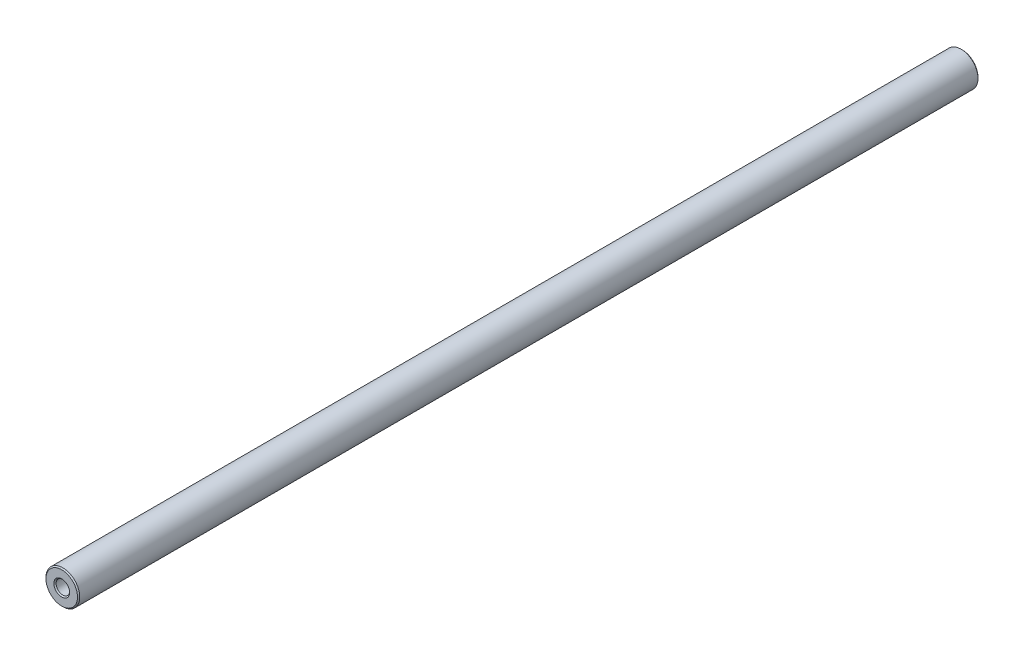
ISO-10303-21;
HEADER;
FILE_DESCRIPTION(('STEP AP214'),'2;1');
FILE_NAME('part.step','',(''),(''),'','','');
FILE_SCHEMA(('AUTOMOTIVE_DESIGN { 1 0 10303 214 1 1 1 1 }'));
ENDSEC;
DATA;
#1=APPLICATION_CONTEXT('core data for automotive mechanical design processes');
#2=APPLICATION_PROTOCOL_DEFINITION('international standard','automotive_design',2000,#1);
#3=PRODUCT_CONTEXT('',#1,'mechanical');
#4=PRODUCT('Part','Part','',(#3));
#5=PRODUCT_RELATED_PRODUCT_CATEGORY('part','',(#4));
#6=PRODUCT_DEFINITION_FORMATION('','',#4);
#7=PRODUCT_DEFINITION_CONTEXT('part definition',#1,'design');
#8=PRODUCT_DEFINITION('design','',#6,#7);
#9=PRODUCT_DEFINITION_SHAPE('','',#8);
#10=(LENGTH_UNIT() NAMED_UNIT(*) SI_UNIT(.MILLI.,.METRE.));
#11=(NAMED_UNIT(*) PLANE_ANGLE_UNIT() SI_UNIT($,.RADIAN.));
#12=(NAMED_UNIT(*) SI_UNIT($,.STERADIAN.) SOLID_ANGLE_UNIT());
#13=UNCERTAINTY_MEASURE_WITH_UNIT(LENGTH_MEASURE(1.E-05),#10,'distance_accuracy_value','');
#14=(GEOMETRIC_REPRESENTATION_CONTEXT(3) GLOBAL_UNCERTAINTY_ASSIGNED_CONTEXT((#13)) GLOBAL_UNIT_ASSIGNED_CONTEXT((#10,
#11,#12)) REPRESENTATION_CONTEXT('',''));
#15=CARTESIAN_POINT('',(0.,0.,0.));
#16=DIRECTION('',(0.,0.,1.));
#17=DIRECTION('',(1.,0.,0.));
#18=AXIS2_PLACEMENT_3D('',#15,#16,#17);
#19=CARTESIAN_POINT('',(0.,0.,160.));
#20=DIRECTION('',(0.,0.,-1.));
#21=DIRECTION('',(-1.,0.,0.));
#22=AXIS2_PLACEMENT_3D('',#19,#20,#21);
#23=CYLINDRICAL_SURFACE('',#22,3.);
#24=CARTESIAN_POINT('',(0.,0.,159.8));
#25=DIRECTION('',(0.,0.,1.));
#26=DIRECTION('',(1.,0.,0.));
#27=AXIS2_PLACEMENT_3D('',#24,#25,#26);
#28=CIRCLE('',#27,3.);
#29=CARTESIAN_POINT('',(3.,0.,159.8));
#30=VERTEX_POINT('',#29);
#31=EDGE_CURVE('E55',#30,#30,#28,.F.);
#32=ORIENTED_EDGE('',*,*,#31,.T.);
#33=EDGE_LOOP('',(#32));
#34=FACE_BOUND('',#33,.T.);
#35=CARTESIAN_POINT('',(0.,0.,0.200000000000006));
#36=DIRECTION('',(0.,0.,1.));
#37=DIRECTION('',(1.,0.,0.));
#38=AXIS2_PLACEMENT_3D('',#35,#36,#37);
#39=CIRCLE('',#38,3.);
#40=CARTESIAN_POINT('',(3.,0.,0.200000000000006));
#41=VERTEX_POINT('',#40);
#42=EDGE_CURVE('E58',#41,#41,#39,.T.);
#43=ORIENTED_EDGE('',*,*,#42,.T.);
#44=EDGE_LOOP('',(#43));
#45=FACE_BOUND('',#44,.T.);
#46=ADVANCED_FACE('F35',(#34,#45),#23,.T.);
#47=CARTESIAN_POINT('',(0.,0.,160.));
#48=DIRECTION('',(0.,0.,1.));
#49=DIRECTION('',(1.,0.,0.));
#50=AXIS2_PLACEMENT_3D('',#47,#48,#49);
#51=PLANE('',#50);
#52=CARTESIAN_POINT('',(0.,0.,160.));
#53=DIRECTION('',(0.,0.,1.));
#54=DIRECTION('',(1.,0.,0.));
#55=AXIS2_PLACEMENT_3D('',#52,#53,#54);
#56=CIRCLE('',#55,2.80000000000003);
#57=CARTESIAN_POINT('',(2.80000000000003,0.,160.));
#58=VERTEX_POINT('',#57);
#59=EDGE_CURVE('E61',#58,#58,#56,.T.);
#60=ORIENTED_EDGE('',*,*,#59,.T.);
#61=EDGE_LOOP('',(#60));
#62=FACE_BOUND('',#61,.T.);
#63=CARTESIAN_POINT('',(0.,0.,160.));
#64=DIRECTION('',(0.,0.,1.));
#65=DIRECTION('',(1.,0.,0.));
#66=AXIS2_PLACEMENT_3D('',#63,#64,#65);
#67=CIRCLE('',#66,1.39999999999993);
#68=CARTESIAN_POINT('',(1.39999999999993,0.,160.));
#69=VERTEX_POINT('',#68);
#70=EDGE_CURVE('E64',#69,#69,#67,.F.);
#71=ORIENTED_EDGE('',*,*,#70,.T.);
#72=EDGE_LOOP('',(#71));
#73=FACE_BOUND('',#72,.T.);
#74=ADVANCED_FACE('F90',(#62,#73),#51,.T.);
#75=CARTESIAN_POINT('',(0.,0.,0.));
#76=DIRECTION('',(0.,0.,1.));
#77=DIRECTION('',(1.,0.,0.));
#78=AXIS2_PLACEMENT_3D('',#75,#76,#77);
#79=PLANE('',#78);
#80=CARTESIAN_POINT('',(0.,0.,0.));
#81=DIRECTION('',(0.,0.,1.));
#82=DIRECTION('',(1.,0.,0.));
#83=AXIS2_PLACEMENT_3D('',#80,#81,#82);
#84=CIRCLE('',#83,2.80000000000001);
#85=CARTESIAN_POINT('',(2.80000000000001,0.,0.));
#86=VERTEX_POINT('',#85);
#87=EDGE_CURVE('E42',#86,#86,#84,.F.);
#88=ORIENTED_EDGE('',*,*,#87,.T.);
#89=EDGE_LOOP('',(#88));
#90=FACE_BOUND('',#89,.T.);
#91=CARTESIAN_POINT('',(0.,0.,0.));
#92=DIRECTION('',(0.,0.,1.));
#93=DIRECTION('',(1.,0.,0.));
#94=AXIS2_PLACEMENT_3D('',#91,#92,#93);
#95=CIRCLE('',#94,1.4);
#96=CARTESIAN_POINT('',(1.4,0.,0.));
#97=VERTEX_POINT('',#96);
#98=EDGE_CURVE('E46',#97,#97,#95,.T.);
#99=ORIENTED_EDGE('',*,*,#98,.T.);
#100=EDGE_LOOP('',(#99));
#101=FACE_BOUND('',#100,.T.);
#102=ADVANCED_FACE('F96',(#90,#101),#79,.F.);
#103=CARTESIAN_POINT('',(0.,0.,148.));
#104=DIRECTION('',(0.,0.,1.));
#105=DIRECTION('',(1.,0.,0.));
#106=AXIS2_PLACEMENT_3D('',#103,#104,#105);
#107=CYLINDRICAL_SURFACE('',#106,1.2);
#108=CARTESIAN_POINT('',(0.,0.,159.8));
#109=DIRECTION('',(0.,0.,1.));
#110=DIRECTION('',(1.,0.,0.));
#111=AXIS2_PLACEMENT_3D('',#108,#109,#110);
#112=CIRCLE('',#111,1.2);
#113=CARTESIAN_POINT('',(1.2,0.,159.8));
#114=VERTEX_POINT('',#113);
#115=EDGE_CURVE('E50',#114,#114,#112,.T.);
#116=ORIENTED_EDGE('',*,*,#115,.T.);
#117=EDGE_LOOP('',(#116));
#118=FACE_BOUND('',#117,.T.);
#119=CARTESIAN_POINT('',(0.,0.,148.));
#120=DIRECTION('',(0.,0.,1.));
#121=DIRECTION('',(1.,0.,0.));
#122=AXIS2_PLACEMENT_3D('',#119,#120,#121);
#123=CIRCLE('',#122,1.2);
#124=CARTESIAN_POINT('',(1.2,0.,148.));
#125=VERTEX_POINT('',#124);
#126=EDGE_CURVE('E67',#125,#125,#123,.T.);
#127=ORIENTED_EDGE('',*,*,#126,.F.);
#128=EDGE_LOOP('',(#127));
#129=FACE_BOUND('',#128,.T.);
#130=ADVANCED_FACE('F86',(#118,#129),#107,.F.);
#131=CARTESIAN_POINT('',(0.,0.,148.));
#132=DIRECTION('',(0.,0.,1.));
#133=DIRECTION('',(1.,0.,0.));
#134=AXIS2_PLACEMENT_3D('',#131,#132,#133);
#135=PLANE('',#134);
#136=ORIENTED_EDGE('',*,*,#126,.T.);
#137=EDGE_LOOP('',(#136));
#138=FACE_BOUND('',#137,.T.);
#139=ADVANCED_FACE('F78',(#138),#135,.T.);
#140=CARTESIAN_POINT('',(0.,0.,12.));
#141=DIRECTION('',(0.,0.,-1.));
#142=DIRECTION('',(-1.,0.,0.));
#143=AXIS2_PLACEMENT_3D('',#140,#141,#142);
#144=CYLINDRICAL_SURFACE('',#143,1.2);
#145=CARTESIAN_POINT('',(0.,0.,0.200000000000016));
#146=DIRECTION('',(0.,0.,1.));
#147=DIRECTION('',(1.,0.,0.));
#148=AXIS2_PLACEMENT_3D('',#145,#146,#147);
#149=CIRCLE('',#148,1.2);
#150=CARTESIAN_POINT('',(1.2,0.,0.200000000000016));
#151=VERTEX_POINT('',#150);
#152=EDGE_CURVE('E10',#151,#151,#149,.F.);
#153=ORIENTED_EDGE('',*,*,#152,.T.);
#154=EDGE_LOOP('',(#153));
#155=FACE_BOUND('',#154,.T.);
#156=CARTESIAN_POINT('',(0.,0.,12.));
#157=DIRECTION('',(0.,0.,-1.));
#158=DIRECTION('',(-1.,0.,0.));
#159=AXIS2_PLACEMENT_3D('',#156,#157,#158);
#160=CIRCLE('',#159,1.2);
#161=CARTESIAN_POINT('',(-1.2,0.,12.));
#162=VERTEX_POINT('',#161);
#163=EDGE_CURVE('E70',#162,#162,#160,.T.);
#164=ORIENTED_EDGE('',*,*,#163,.F.);
#165=EDGE_LOOP('',(#164));
#166=FACE_BOUND('',#165,.T.);
#167=ADVANCED_FACE('F76',(#155,#166),#144,.F.);
#168=CARTESIAN_POINT('',(0.,0.,12.));
#169=DIRECTION('',(0.,0.,-1.));
#170=DIRECTION('',(-1.,0.,0.));
#171=AXIS2_PLACEMENT_3D('',#168,#169,#170);
#172=PLANE('',#171);
#173=ORIENTED_EDGE('',*,*,#163,.T.);
#174=EDGE_LOOP('',(#173));
#175=FACE_BOUND('',#174,.T.);
#176=ADVANCED_FACE('F74',(#175),#172,.T.);
#177=CARTESIAN_POINT('',(0.,0.,160.));
#178=DIRECTION('',(0.,0.,-1.));
#179=DIRECTION('',(-1.,0.,0.));
#180=AXIS2_PLACEMENT_3D('',#177,#178,#179);
#181=CONICAL_SURFACE('',#180,2.80000000000003,0.785398163397509);
#182=ORIENTED_EDGE('',*,*,#31,.F.);
#183=EDGE_LOOP('',(#182));
#184=FACE_BOUND('',#183,.T.);
#185=ORIENTED_EDGE('',*,*,#59,.F.);
#186=EDGE_LOOP('',(#185));
#187=FACE_BOUND('',#186,.T.);
#188=ADVANCED_FACE('F84',(#184,#187),#181,.T.);
#189=CARTESIAN_POINT('',(0.,0.,159.8));
#190=DIRECTION('',(0.,0.,1.));
#191=DIRECTION('',(1.,0.,0.));
#192=AXIS2_PLACEMENT_3D('',#189,#190,#191);
#193=CONICAL_SURFACE('',#192,1.2,0.785398163397465);
#194=ORIENTED_EDGE('',*,*,#70,.F.);
#195=EDGE_LOOP('',(#194));
#196=FACE_BOUND('',#195,.T.);
#197=ORIENTED_EDGE('',*,*,#115,.F.);
#198=EDGE_LOOP('',(#197));
#199=FACE_BOUND('',#198,.T.);
#200=ADVANCED_FACE('F104',(#196,#199),#193,.F.);
#201=CARTESIAN_POINT('',(0.,0.,0.200000000000006));
#202=DIRECTION('',(0.,0.,1.));
#203=DIRECTION('',(1.,0.,0.));
#204=AXIS2_PLACEMENT_3D('',#201,#202,#203);
#205=CONICAL_SURFACE('',#204,3.,0.785398163397406);
#206=ORIENTED_EDGE('',*,*,#87,.F.);
#207=EDGE_LOOP('',(#206));
#208=FACE_BOUND('',#207,.T.);
#209=ORIENTED_EDGE('',*,*,#42,.F.);
#210=EDGE_LOOP('',(#209));
#211=FACE_BOUND('',#210,.T.);
#212=ADVANCED_FACE('F107',(#208,#211),#205,.T.);
#213=CARTESIAN_POINT('',(0.,0.,0.200000000000016));
#214=DIRECTION('',(0.,0.,-1.));
#215=DIRECTION('',(-1.,0.,0.));
#216=AXIS2_PLACEMENT_3D('',#213,#214,#215);
#217=CONICAL_SURFACE('',#216,1.2,0.785398163397404);
#218=ORIENTED_EDGE('',*,*,#98,.F.);
#219=EDGE_LOOP('',(#218));
#220=FACE_BOUND('',#219,.T.);
#221=ORIENTED_EDGE('',*,*,#152,.F.);
#222=EDGE_LOOP('',(#221));
#223=FACE_BOUND('',#222,.T.);
#224=ADVANCED_FACE('F37',(#220,#223),#217,.F.);
#225=CLOSED_SHELL('',(#46,#74,#102,#130,#139,#167,#176,#188,#200,#212,#224));
#226=MANIFOLD_SOLID_BREP('B2',#225);
#227=ADVANCED_BREP_SHAPE_REPRESENTATION('',(#18,#226),#14);
#228=SHAPE_DEFINITION_REPRESENTATION(#9,#227);
ENDSEC;
END-ISO-10303-21;
